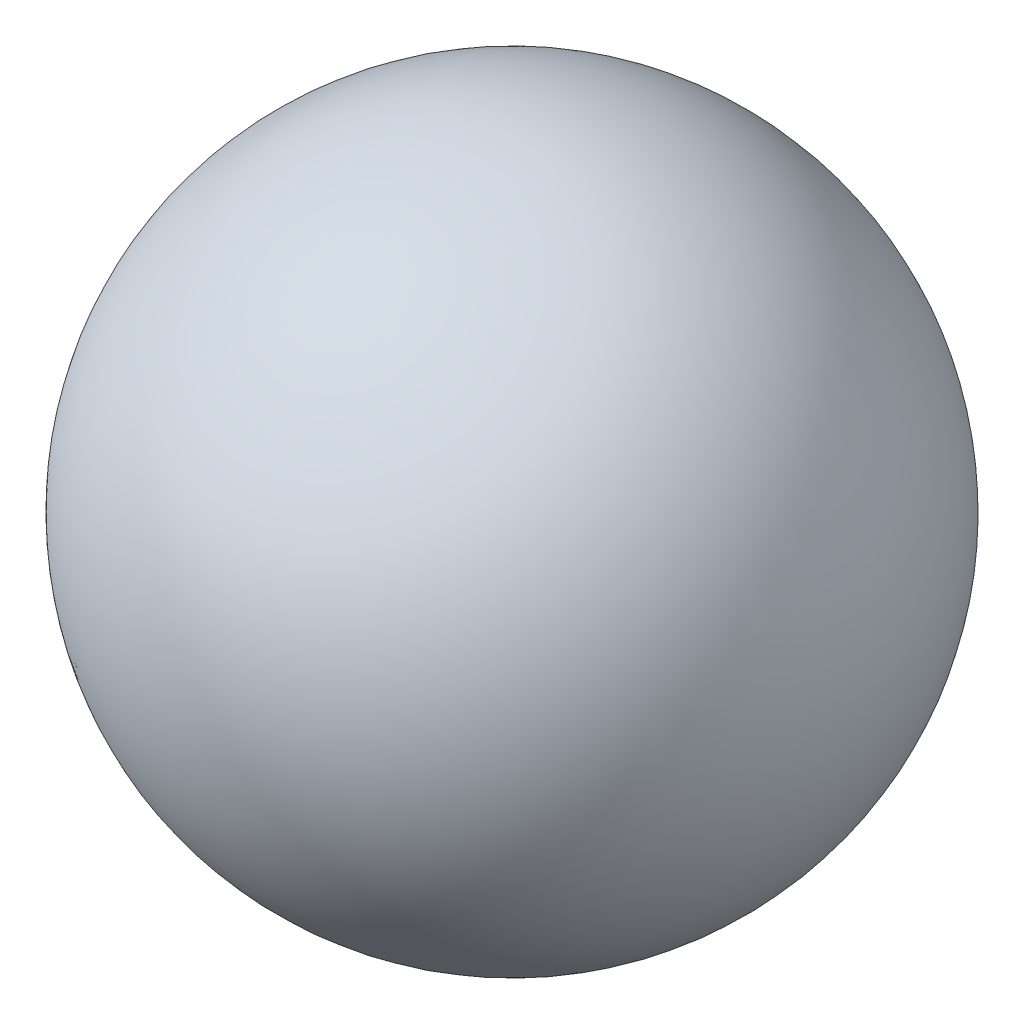
ISO-10303-21;
HEADER;
FILE_DESCRIPTION(('STEP AP214'),'2;1');
FILE_NAME('part.step','',(''),(''),'','','');
FILE_SCHEMA(('AUTOMOTIVE_DESIGN { 1 0 10303 214 1 1 1 1 }'));
ENDSEC;
DATA;
#1=APPLICATION_CONTEXT('core data for automotive mechanical design processes');
#2=APPLICATION_PROTOCOL_DEFINITION('international standard','automotive_design',2000,#1);
#3=PRODUCT_CONTEXT('',#1,'mechanical');
#4=PRODUCT('Part','Part','',(#3));
#5=PRODUCT_RELATED_PRODUCT_CATEGORY('part','',(#4));
#6=PRODUCT_DEFINITION_FORMATION('','',#4);
#7=PRODUCT_DEFINITION_CONTEXT('part definition',#1,'design');
#8=PRODUCT_DEFINITION('design','',#6,#7);
#9=PRODUCT_DEFINITION_SHAPE('','',#8);
#10=(LENGTH_UNIT() NAMED_UNIT(*) SI_UNIT(.MILLI.,.METRE.));
#11=(NAMED_UNIT(*) PLANE_ANGLE_UNIT() SI_UNIT($,.RADIAN.));
#12=(NAMED_UNIT(*) SI_UNIT($,.STERADIAN.) SOLID_ANGLE_UNIT());
#13=UNCERTAINTY_MEASURE_WITH_UNIT(LENGTH_MEASURE(1.E-05),#10,'distance_accuracy_value','');
#14=(GEOMETRIC_REPRESENTATION_CONTEXT(3) GLOBAL_UNCERTAINTY_ASSIGNED_CONTEXT((#13)) GLOBAL_UNIT_ASSIGNED_CONTEXT((#10,
#11,#12)) REPRESENTATION_CONTEXT('',''));
#15=CARTESIAN_POINT('',(0.,0.,0.));
#16=DIRECTION('',(0.,0.,1.));
#17=DIRECTION('',(1.,0.,0.));
#18=AXIS2_PLACEMENT_3D('',#15,#16,#17);
#19=CARTESIAN_POINT('',(0.,2.36880771697496,2.36880771697491));
#20=DIRECTION('',(0.0632926493718599,0.39825974424842,0.915086453099746));
#21=DIRECTION('',(-0.627715645181082,-0.696953102688074,0.346741173569516));
#22=AXIS2_PLACEMENT_3D('',#19,#20,#21);
#23=SPHERICAL_SURFACE('',#22,0.794);
#24=CARTESIAN_POINT('',(0.0502543636012568,2.68502595390821,3.0953863607361));
#25=VERTEX_POINT('',#24);
#26=VERTEX_LOOP('',#25);
#27=FACE_BOUND('',#26,.T.);
#28=CARTESIAN_POINT('',(-0.0502543636012568,2.05258948004172,1.64222907321371));
#29=VERTEX_POINT('',#28);
#30=VERTEX_LOOP('',#29);
#31=FACE_BOUND('',#30,.T.);
#32=ADVANCED_FACE('F16',(#27,#31),#23,.T.);
#33=CLOSED_SHELL('',(#32));
#34=MANIFOLD_SOLID_BREP('B1',#33);
#35=ADVANCED_BREP_SHAPE_REPRESENTATION('',(#18,#34),#14);
#36=SHAPE_DEFINITION_REPRESENTATION(#9,#35);
ENDSEC;
END-ISO-10303-21;
